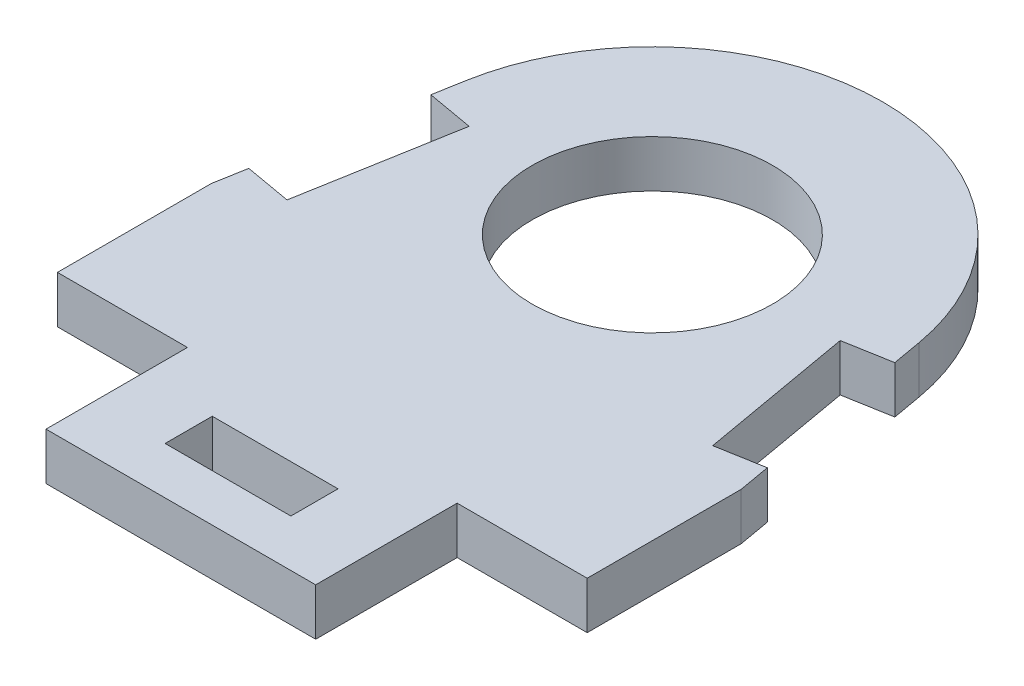
ISO-10303-21;
HEADER;
FILE_DESCRIPTION(('STEP AP214'),'2;1');
FILE_NAME('part.step','',(''),(''),'','','');
FILE_SCHEMA(('AUTOMOTIVE_DESIGN { 1 0 10303 214 1 1 1 1 }'));
ENDSEC;
DATA;
#1=APPLICATION_CONTEXT('core data for automotive mechanical design processes');
#2=APPLICATION_PROTOCOL_DEFINITION('international standard','automotive_design',2000,#1);
#3=PRODUCT_CONTEXT('',#1,'mechanical');
#4=PRODUCT('Part','Part','',(#3));
#5=PRODUCT_RELATED_PRODUCT_CATEGORY('part','',(#4));
#6=PRODUCT_DEFINITION_FORMATION('','',#4);
#7=PRODUCT_DEFINITION_CONTEXT('part definition',#1,'design');
#8=PRODUCT_DEFINITION('design','',#6,#7);
#9=PRODUCT_DEFINITION_SHAPE('','',#8);
#10=(LENGTH_UNIT() NAMED_UNIT(*) SI_UNIT(.MILLI.,.METRE.));
#11=(NAMED_UNIT(*) PLANE_ANGLE_UNIT() SI_UNIT($,.RADIAN.));
#12=(NAMED_UNIT(*) SI_UNIT($,.STERADIAN.) SOLID_ANGLE_UNIT());
#13=UNCERTAINTY_MEASURE_WITH_UNIT(LENGTH_MEASURE(1.E-05),#10,'distance_accuracy_value','');
#14=(GEOMETRIC_REPRESENTATION_CONTEXT(3) GLOBAL_UNCERTAINTY_ASSIGNED_CONTEXT((#13)) GLOBAL_UNIT_ASSIGNED_CONTEXT((#10,
#11,#12)) REPRESENTATION_CONTEXT('',''));
#15=CARTESIAN_POINT('',(0.,0.,0.));
#16=DIRECTION('',(0.,0.,1.));
#17=DIRECTION('',(1.,0.,0.));
#18=AXIS2_PLACEMENT_3D('',#15,#16,#17);
#19=CARTESIAN_POINT('',(4.,1.5,0.));
#20=DIRECTION('',(-1.,0.,0.));
#21=DIRECTION('',(0.,0.,1.));
#22=AXIS2_PLACEMENT_3D('',#19,#20,#21);
#23=PLANE('',#22);
#24=DIRECTION('',(0.,0.,-1.));
#25=VECTOR('',#24,1.);
#26=CARTESIAN_POINT('',(4.,-1.5,0.));
#27=LINE('',#26,#25);
#28=CARTESIAN_POINT('',(4.,-1.5,6.));
#29=VERTEX_POINT('',#28);
#30=CARTESIAN_POINT('',(4.,-1.5,3.));
#31=VERTEX_POINT('',#30);
#32=EDGE_CURVE('E271',#29,#31,#27,.T.);
#33=ORIENTED_EDGE('',*,*,#32,.F.);
#34=DIRECTION('',(0.,-1.,0.));
#35=VECTOR('',#34,1.);
#36=CARTESIAN_POINT('',(4.,1.5,6.));
#37=LINE('',#36,#35);
#38=CARTESIAN_POINT('',(4.,1.5,6.));
#39=VERTEX_POINT('',#38);
#40=EDGE_CURVE('E11',#39,#29,#37,.T.);
#41=ORIENTED_EDGE('',*,*,#40,.F.);
#42=DIRECTION('',(0.,0.,-1.));
#43=VECTOR('',#42,1.);
#44=CARTESIAN_POINT('',(4.,1.5,0.));
#45=LINE('',#44,#43);
#46=CARTESIAN_POINT('',(4.,1.5,3.));
#47=VERTEX_POINT('',#46);
#48=EDGE_CURVE('E219',#39,#47,#45,.T.);
#49=ORIENTED_EDGE('',*,*,#48,.T.);
#50=DIRECTION('',(0.,-1.,0.));
#51=VECTOR('',#50,1.);
#52=CARTESIAN_POINT('',(4.,1.5,3.));
#53=LINE('',#52,#51);
#54=EDGE_CURVE('E139',#47,#31,#53,.T.);
#55=ORIENTED_EDGE('',*,*,#54,.T.);
#56=EDGE_LOOP('',(#33,#41,#49,#55));
#57=FACE_BOUND('',#56,.T.);
#58=ADVANCED_FACE('F43',(#57),#23,.T.);
#59=CARTESIAN_POINT('',(0.,1.5,6.));
#60=DIRECTION('',(0.,0.,-1.));
#61=DIRECTION('',(-1.,0.,0.));
#62=AXIS2_PLACEMENT_3D('',#59,#60,#61);
#63=PLANE('',#62);
#64=DIRECTION('',(1.,0.,0.));
#65=VECTOR('',#64,1.);
#66=CARTESIAN_POINT('',(0.,-1.5,6.));
#67=LINE('',#66,#65);
#68=CARTESIAN_POINT('',(-4.,-1.5,6.));
#69=VERTEX_POINT('',#68);
#70=EDGE_CURVE('E209',#69,#29,#67,.T.);
#71=ORIENTED_EDGE('',*,*,#70,.F.);
#72=DIRECTION('',(0.,-1.,0.));
#73=VECTOR('',#72,1.);
#74=CARTESIAN_POINT('',(-4.,1.5,6.));
#75=LINE('',#74,#73);
#76=CARTESIAN_POINT('',(-4.,1.5,6.));
#77=VERTEX_POINT('',#76);
#78=EDGE_CURVE('E53',#77,#69,#75,.T.);
#79=ORIENTED_EDGE('',*,*,#78,.F.);
#80=DIRECTION('',(1.,0.,0.));
#81=VECTOR('',#80,1.);
#82=CARTESIAN_POINT('',(0.,1.5,6.));
#83=LINE('',#82,#81);
#84=EDGE_CURVE('E207',#77,#39,#83,.T.);
#85=ORIENTED_EDGE('',*,*,#84,.T.);
#86=ORIENTED_EDGE('',*,*,#40,.T.);
#87=EDGE_LOOP('',(#71,#79,#85,#86));
#88=FACE_BOUND('',#87,.T.);
#89=ADVANCED_FACE('F205',(#88),#63,.T.);
#90=CARTESIAN_POINT('',(-4.,1.5,0.));
#91=DIRECTION('',(-1.,0.,0.));
#92=DIRECTION('',(0.,0.,1.));
#93=AXIS2_PLACEMENT_3D('',#90,#91,#92);
#94=PLANE('',#93);
#95=DIRECTION('',(0.,0.,-1.));
#96=VECTOR('',#95,1.);
#97=CARTESIAN_POINT('',(-4.,-1.5,0.));
#98=LINE('',#97,#96);
#99=CARTESIAN_POINT('',(-4.,-1.5,3.));
#100=VERTEX_POINT('',#99);
#101=EDGE_CURVE('E274',#69,#100,#98,.T.);
#102=ORIENTED_EDGE('',*,*,#101,.T.);
#103=DIRECTION('',(0.,-1.,0.));
#104=VECTOR('',#103,1.);
#105=CARTESIAN_POINT('',(-4.,1.5,3.));
#106=LINE('',#105,#104);
#107=CARTESIAN_POINT('',(-4.,1.5,3.));
#108=VERTEX_POINT('',#107);
#109=EDGE_CURVE('E212',#108,#100,#106,.T.);
#110=ORIENTED_EDGE('',*,*,#109,.F.);
#111=DIRECTION('',(0.,0.,-1.));
#112=VECTOR('',#111,1.);
#113=CARTESIAN_POINT('',(-4.,1.5,0.));
#114=LINE('',#113,#112);
#115=EDGE_CURVE('E215',#77,#108,#114,.T.);
#116=ORIENTED_EDGE('',*,*,#115,.F.);
#117=ORIENTED_EDGE('',*,*,#78,.T.);
#118=EDGE_LOOP('',(#102,#110,#116,#117));
#119=FACE_BOUND('',#118,.T.);
#120=ADVANCED_FACE('F216',(#119),#94,.F.);
#121=CARTESIAN_POINT('',(0.,1.5,-21.));
#122=DIRECTION('',(0.,-1.,0.));
#123=DIRECTION('',(0.,0.,-1.));
#124=AXIS2_PLACEMENT_3D('',#121,#122,#123);
#125=CYLINDRICAL_SURFACE('',#124,14.65);
#126=CARTESIAN_POINT('',(0.,-1.5,-21.));
#127=DIRECTION('',(0.,1.,0.));
#128=DIRECTION('',(0.,0.,1.));
#129=AXIS2_PLACEMENT_3D('',#126,#127,#128);
#130=CIRCLE('',#129,14.65);
#131=CARTESIAN_POINT('',(-14.4274335816288,-1.5,-23.5439458028206));
#132=VERTEX_POINT('',#131);
#133=CARTESIAN_POINT('',(14.4274335816288,-1.5,-23.5439458028206));
#134=VERTEX_POINT('',#133);
#135=EDGE_CURVE('E227',#132,#134,#130,.F.);
#136=ORIENTED_EDGE('',*,*,#135,.F.);
#137=DIRECTION('',(0.,-1.,0.));
#138=VECTOR('',#137,1.);
#139=CARTESIAN_POINT('',(-14.4274335816288,1.5,-23.5439458028206));
#140=LINE('',#139,#138);
#141=CARTESIAN_POINT('',(-14.4274335816288,1.5,-23.5439458028206));
#142=VERTEX_POINT('',#141);
#143=EDGE_CURVE('E47',#142,#132,#140,.T.);
#144=ORIENTED_EDGE('',*,*,#143,.F.);
#145=CARTESIAN_POINT('',(0.,1.5,-21.));
#146=DIRECTION('',(0.,1.,0.));
#147=DIRECTION('',(0.,0.,1.));
#148=AXIS2_PLACEMENT_3D('',#145,#146,#147);
#149=CIRCLE('',#148,14.65);
#150=CARTESIAN_POINT('',(14.4274335816288,1.5,-23.5439458028206));
#151=VERTEX_POINT('',#150);
#152=EDGE_CURVE('E277',#142,#151,#149,.F.);
#153=ORIENTED_EDGE('',*,*,#152,.T.);
#154=DIRECTION('',(0.,-1.,0.));
#155=VECTOR('',#154,1.);
#156=CARTESIAN_POINT('',(14.4274335816288,1.5,-23.5439458028206));
#157=LINE('',#156,#155);
#158=EDGE_CURVE('E226',#151,#134,#157,.T.);
#159=ORIENTED_EDGE('',*,*,#158,.T.);
#160=EDGE_LOOP('',(#136,#144,#153,#159));
#161=FACE_BOUND('',#160,.T.);
#162=ADVANCED_FACE('F45',(#161),#125,.T.);
#163=CARTESIAN_POINT('',(-18.0186450865484,1.5,-3.17717328456859));
#164=DIRECTION('',(-0.984807753012207,0.,-0.173648177666935));
#165=DIRECTION('',(-0.173648177666935,0.,0.984807753012207));
#166=AXIS2_PLACEMENT_3D('',#163,#164,#165);
#167=PLANE('',#166);
#168=DIRECTION('',(0.173648177666935,0.,-0.984807753012207));
#169=VECTOR('',#168,1.);
#170=CARTESIAN_POINT('',(-18.0186450865484,-1.5,-3.17717328456859));
#171=LINE('',#170,#169);
#172=CARTESIAN_POINT('',(-14.7586065503315,-1.5,-21.6657705662686));
#173=VERTEX_POINT('',#172);
#174=EDGE_CURVE('E230',#173,#132,#171,.T.);
#175=ORIENTED_EDGE('',*,*,#174,.F.);
#176=DIRECTION('',(0.,-1.,0.));
#177=VECTOR('',#176,1.);
#178=CARTESIAN_POINT('',(-14.7586065503315,1.5,-21.6657705662686));
#179=LINE('',#178,#177);
#180=CARTESIAN_POINT('',(-14.7586065503315,1.5,-21.6657705662686));
#181=VERTEX_POINT('',#180);
#182=EDGE_CURVE('E318',#181,#173,#179,.T.);
#183=ORIENTED_EDGE('',*,*,#182,.F.);
#184=DIRECTION('',(0.173648177666935,0.,-0.984807753012207));
#185=VECTOR('',#184,1.);
#186=CARTESIAN_POINT('',(-18.0186450865484,1.5,-3.17717328456859));
#187=LINE('',#186,#185);
#188=EDGE_CURVE('E327',#181,#142,#187,.T.);
#189=ORIENTED_EDGE('',*,*,#188,.T.);
#190=ORIENTED_EDGE('',*,*,#143,.T.);
#191=EDGE_LOOP('',(#175,#183,#189,#190));
#192=FACE_BOUND('',#191,.T.);
#193=ADVANCED_FACE('F325',(#192),#167,.T.);
#194=CARTESIAN_POINT('',(3.26003853621698,1.5,-18.4885972817));
#195=DIRECTION('',(0.173648177666935,0.,-0.984807753012207));
#196=DIRECTION('',(-0.984807753012207,0.,-0.173648177666935));
#197=AXIS2_PLACEMENT_3D('',#194,#195,#196);
#198=PLANE('',#197);
#199=DIRECTION('',(0.984807753012207,0.,0.173648177666935));
#200=VECTOR('',#199,1.);
#201=CARTESIAN_POINT('',(3.26003853621698,-1.5,-18.4885972817));
#202=LINE('',#201,#200);
#203=CARTESIAN_POINT('',(-11.8041832912948,-1.5,-21.1448260332678));
#204=VERTEX_POINT('',#203);
#205=EDGE_CURVE('E233',#173,#204,#202,.T.);
#206=ORIENTED_EDGE('',*,*,#205,.T.);
#207=DIRECTION('',(0.,-1.,0.));
#208=VECTOR('',#207,1.);
#209=CARTESIAN_POINT('',(-11.8041832912948,1.5,-21.1448260332678));
#210=LINE('',#209,#208);
#211=CARTESIAN_POINT('',(-11.8041832912948,1.5,-21.1448260332678));
#212=VERTEX_POINT('',#211);
#213=EDGE_CURVE('E316',#212,#204,#210,.T.);
#214=ORIENTED_EDGE('',*,*,#213,.F.);
#215=DIRECTION('',(0.984807753012207,0.,0.173648177666935));
#216=VECTOR('',#215,1.);
#217=CARTESIAN_POINT('',(3.26003853621698,1.5,-18.4885972817));
#218=LINE('',#217,#216);
#219=EDGE_CURVE('E346',#181,#212,#218,.T.);
#220=ORIENTED_EDGE('',*,*,#219,.F.);
#221=ORIENTED_EDGE('',*,*,#182,.T.);
#222=EDGE_LOOP('',(#206,#214,#220,#221));
#223=FACE_BOUND('',#222,.T.);
#224=ADVANCED_FACE('F336',(#223),#198,.F.);
#225=CARTESIAN_POINT('',(-15.0642218275118,1.5,-2.65622875156778));
#226=DIRECTION('',(0.984807753012207,0.,0.173648177666935));
#227=DIRECTION('',(0.173648177666935,0.,-0.984807753012207));
#228=AXIS2_PLACEMENT_3D('',#225,#226,#227);
#229=PLANE('',#228);
#230=DIRECTION('',(-0.173648177666935,0.,0.984807753012207));
#231=VECTOR('',#230,1.);
#232=CARTESIAN_POINT('',(-15.0642218275118,-1.5,-2.65622875156778));
#233=LINE('',#232,#231);
#234=CARTESIAN_POINT('',(-13.5406650679642,-1.5,-11.2967485031457));
#235=VERTEX_POINT('',#234);
#236=EDGE_CURVE('E236',#204,#235,#233,.T.);
#237=ORIENTED_EDGE('',*,*,#236,.T.);
#238=DIRECTION('',(0.,-1.,0.));
#239=VECTOR('',#238,1.);
#240=CARTESIAN_POINT('',(-13.5406650679642,1.5,-11.2967485031457));
#241=LINE('',#240,#239);
#242=CARTESIAN_POINT('',(-13.5406650679642,1.5,-11.2967485031457));
#243=VERTEX_POINT('',#242);
#244=EDGE_CURVE('E314',#243,#235,#241,.T.);
#245=ORIENTED_EDGE('',*,*,#244,.F.);
#246=DIRECTION('',(-0.173648177666935,0.,0.984807753012207));
#247=VECTOR('',#246,1.);
#248=CARTESIAN_POINT('',(-15.0642218275118,1.5,-2.65622875156778));
#249=LINE('',#248,#247);
#250=EDGE_CURVE('E341',#212,#243,#249,.T.);
#251=ORIENTED_EDGE('',*,*,#250,.F.);
#252=ORIENTED_EDGE('',*,*,#213,.T.);
#253=EDGE_LOOP('',(#237,#245,#251,#252));
#254=FACE_BOUND('',#253,.T.);
#255=ADVANCED_FACE('F339',(#254),#229,.F.);
#256=CARTESIAN_POINT('',(1.52355675954763,1.5,-8.64051975157789));
#257=DIRECTION('',(0.173648177666935,0.,-0.984807753012207));
#258=DIRECTION('',(-0.984807753012207,0.,-0.173648177666935));
#259=AXIS2_PLACEMENT_3D('',#256,#257,#258);
#260=PLANE('',#259);
#261=DIRECTION('',(0.984807753012207,0.,0.173648177666935));
#262=VECTOR('',#261,1.);
#263=CARTESIAN_POINT('',(1.52355675954763,-1.5,-8.64051975157789));
#264=LINE('',#263,#262);
#265=CARTESIAN_POINT('',(-16.4950883270008,-1.5,-11.8176930361465));
#266=VERTEX_POINT('',#265);
#267=EDGE_CURVE('E239',#266,#235,#264,.T.);
#268=ORIENTED_EDGE('',*,*,#267,.F.);
#269=DIRECTION('',(0.,-1.,0.));
#270=VECTOR('',#269,1.);
#271=CARTESIAN_POINT('',(-16.4950883270008,1.5,-11.8176930361465));
#272=LINE('',#271,#270);
#273=CARTESIAN_POINT('',(-16.4950883270008,1.5,-11.8176930361465));
#274=VERTEX_POINT('',#273);
#275=EDGE_CURVE('E312',#274,#266,#272,.T.);
#276=ORIENTED_EDGE('',*,*,#275,.F.);
#277=DIRECTION('',(0.984807753012207,0.,0.173648177666935));
#278=VECTOR('',#277,1.);
#279=CARTESIAN_POINT('',(1.52355675954763,1.5,-8.64051975157789));
#280=LINE('',#279,#278);
#281=EDGE_CURVE('E345',#274,#243,#280,.T.);
#282=ORIENTED_EDGE('',*,*,#281,.T.);
#283=ORIENTED_EDGE('',*,*,#244,.T.);
#284=EDGE_LOOP('',(#268,#276,#282,#283));
#285=FACE_BOUND('',#284,.T.);
#286=ADVANCED_FACE('F445',(#285),#260,.T.);
#287=CARTESIAN_POINT('',(-16.852566459004,-1.5,-9.79033380520578));
#288=VERTEX_POINT('',#287);
#289=EDGE_CURVE('E234',#288,#266,#171,.T.);
#290=ORIENTED_EDGE('',*,*,#289,.F.);
#291=DIRECTION('',(0.,-1.,0.));
#292=VECTOR('',#291,1.);
#293=CARTESIAN_POINT('',(-16.852566459004,1.5,-9.79033380520578));
#294=LINE('',#293,#292);
#295=CARTESIAN_POINT('',(-16.852566459004,1.5,-9.79033380520578));
#296=VERTEX_POINT('',#295);
#297=EDGE_CURVE('E310',#296,#288,#294,.T.);
#298=ORIENTED_EDGE('',*,*,#297,.F.);
#299=EDGE_CURVE('E348',#296,#274,#187,.T.);
#300=ORIENTED_EDGE('',*,*,#299,.T.);
#301=ORIENTED_EDGE('',*,*,#275,.T.);
#302=EDGE_LOOP('',(#290,#298,#300,#301));
#303=FACE_BOUND('',#302,.T.);
#304=ADVANCED_FACE('F391',(#303),#167,.T.);
#305=CARTESIAN_POINT('',(-16.852566459004,1.5,0.));
#306=DIRECTION('',(-1.,0.,0.));
#307=DIRECTION('',(0.,0.,1.));
#308=AXIS2_PLACEMENT_3D('',#305,#306,#307);
#309=PLANE('',#308);
#310=DIRECTION('',(0.,0.,-1.));
#311=VECTOR('',#310,1.);
#312=CARTESIAN_POINT('',(-16.852566459004,-1.5,0.));
#313=LINE('',#312,#311);
#314=CARTESIAN_POINT('',(-16.852566459004,-1.5,0.));
#315=VERTEX_POINT('',#314);
#316=EDGE_CURVE('E242',#315,#288,#313,.T.);
#317=ORIENTED_EDGE('',*,*,#316,.F.);
#318=DIRECTION('',(0.,-1.,0.));
#319=VECTOR('',#318,1.);
#320=CARTESIAN_POINT('',(-16.852566459004,1.5,0.));
#321=LINE('',#320,#319);
#322=CARTESIAN_POINT('',(-16.852566459004,1.5,0.));
#323=VERTEX_POINT('',#322);
#324=EDGE_CURVE('E308',#323,#315,#321,.T.);
#325=ORIENTED_EDGE('',*,*,#324,.F.);
#326=DIRECTION('',(0.,0.,-1.));
#327=VECTOR('',#326,1.);
#328=CARTESIAN_POINT('',(-16.852566459004,1.5,0.));
#329=LINE('',#328,#327);
#330=EDGE_CURVE('E353',#323,#296,#329,.T.);
#331=ORIENTED_EDGE('',*,*,#330,.T.);
#332=ORIENTED_EDGE('',*,*,#297,.T.);
#333=EDGE_LOOP('',(#317,#325,#331,#332));
#334=FACE_BOUND('',#333,.T.);
#335=ADVANCED_FACE('F396',(#334),#309,.T.);
#336=CARTESIAN_POINT('',(0.,1.5,0.));
#337=DIRECTION('',(0.,0.,-1.));
#338=DIRECTION('',(-1.,0.,0.));
#339=AXIS2_PLACEMENT_3D('',#336,#337,#338);
#340=PLANE('',#339);
#341=DIRECTION('',(1.,0.,0.));
#342=VECTOR('',#341,1.);
#343=CARTESIAN_POINT('',(0.,-1.5,0.));
#344=LINE('',#343,#342);
#345=CARTESIAN_POINT('',(-8.57886645900403,-1.5,0.));
#346=VERTEX_POINT('',#345);
#347=EDGE_CURVE('E245',#315,#346,#344,.T.);
#348=ORIENTED_EDGE('',*,*,#347,.T.);
#349=DIRECTION('',(0.,-1.,0.));
#350=VECTOR('',#349,1.);
#351=CARTESIAN_POINT('',(-8.57886645900403,1.5,0.));
#352=LINE('',#351,#350);
#353=CARTESIAN_POINT('',(-8.57886645900403,1.5,0.));
#354=VERTEX_POINT('',#353);
#355=EDGE_CURVE('E305',#354,#346,#352,.T.);
#356=ORIENTED_EDGE('',*,*,#355,.F.);
#357=DIRECTION('',(1.,0.,0.));
#358=VECTOR('',#357,1.);
#359=CARTESIAN_POINT('',(0.,1.5,0.));
#360=LINE('',#359,#358);
#361=EDGE_CURVE('E356',#323,#354,#360,.T.);
#362=ORIENTED_EDGE('',*,*,#361,.F.);
#363=ORIENTED_EDGE('',*,*,#324,.T.);
#364=EDGE_LOOP('',(#348,#356,#362,#363));
#365=FACE_BOUND('',#364,.T.);
#366=ADVANCED_FACE('F401',(#365),#340,.F.);
#367=CARTESIAN_POINT('',(-8.57886645900403,1.5,0.));
#368=DIRECTION('',(1.,0.,0.));
#369=DIRECTION('',(0.,0.,-1.));
#370=AXIS2_PLACEMENT_3D('',#367,#368,#369);
#371=PLANE('',#370);
#372=DIRECTION('',(0.,0.,1.));
#373=VECTOR('',#372,1.);
#374=CARTESIAN_POINT('',(-8.57886645900403,-1.5,0.));
#375=LINE('',#374,#373);
#376=CARTESIAN_POINT('',(-8.57886645900403,-1.5,9.));
#377=VERTEX_POINT('',#376);
#378=EDGE_CURVE('E247',#346,#377,#375,.T.);
#379=ORIENTED_EDGE('',*,*,#378,.T.);
#380=DIRECTION('',(0.,-1.,0.));
#381=VECTOR('',#380,1.);
#382=CARTESIAN_POINT('',(-8.57886645900403,1.5,9.));
#383=LINE('',#382,#381);
#384=CARTESIAN_POINT('',(-8.57886645900403,1.5,9.));
#385=VERTEX_POINT('',#384);
#386=EDGE_CURVE('E302',#385,#377,#383,.T.);
#387=ORIENTED_EDGE('',*,*,#386,.F.);
#388=DIRECTION('',(0.,0.,1.));
#389=VECTOR('',#388,1.);
#390=CARTESIAN_POINT('',(-8.57886645900403,1.5,0.));
#391=LINE('',#390,#389);
#392=EDGE_CURVE('E358',#354,#385,#391,.T.);
#393=ORIENTED_EDGE('',*,*,#392,.F.);
#394=ORIENTED_EDGE('',*,*,#355,.T.);
#395=EDGE_LOOP('',(#379,#387,#393,#394));
#396=FACE_BOUND('',#395,.T.);
#397=ADVANCED_FACE('F407',(#396),#371,.F.);
#398=CARTESIAN_POINT('',(0.,1.5,9.));
#399=DIRECTION('',(0.,0.,-1.));
#400=DIRECTION('',(-1.,0.,0.));
#401=AXIS2_PLACEMENT_3D('',#398,#399,#400);
#402=PLANE('',#401);
#403=DIRECTION('',(1.,0.,0.));
#404=VECTOR('',#403,1.);
#405=CARTESIAN_POINT('',(0.,-1.5,9.));
#406=LINE('',#405,#404);
#407=CARTESIAN_POINT('',(8.57886645900403,-1.5,9.));
#408=VERTEX_POINT('',#407);
#409=EDGE_CURVE('E250',#377,#408,#406,.T.);
#410=ORIENTED_EDGE('',*,*,#409,.T.);
#411=DIRECTION('',(0.,-1.,0.));
#412=VECTOR('',#411,1.);
#413=CARTESIAN_POINT('',(8.57886645900403,1.5,9.));
#414=LINE('',#413,#412);
#415=CARTESIAN_POINT('',(8.57886645900403,1.5,9.));
#416=VERTEX_POINT('',#415);
#417=EDGE_CURVE('E299',#416,#408,#414,.T.);
#418=ORIENTED_EDGE('',*,*,#417,.F.);
#419=DIRECTION('',(1.,0.,0.));
#420=VECTOR('',#419,1.);
#421=CARTESIAN_POINT('',(0.,1.5,9.));
#422=LINE('',#421,#420);
#423=EDGE_CURVE('E361',#385,#416,#422,.T.);
#424=ORIENTED_EDGE('',*,*,#423,.F.);
#425=ORIENTED_EDGE('',*,*,#386,.T.);
#426=EDGE_LOOP('',(#410,#418,#424,#425));
#427=FACE_BOUND('',#426,.T.);
#428=ADVANCED_FACE('F411',(#427),#402,.F.);
#429=CARTESIAN_POINT('',(8.57886645900403,1.5,0.));
#430=DIRECTION('',(-1.,0.,0.));
#431=DIRECTION('',(0.,0.,1.));
#432=AXIS2_PLACEMENT_3D('',#429,#430,#431);
#433=PLANE('',#432);
#434=DIRECTION('',(0.,0.,-1.));
#435=VECTOR('',#434,1.);
#436=CARTESIAN_POINT('',(8.57886645900403,-1.5,0.));
#437=LINE('',#436,#435);
#438=CARTESIAN_POINT('',(8.57886645900403,-1.5,0.));
#439=VERTEX_POINT('',#438);
#440=EDGE_CURVE('E252',#408,#439,#437,.T.);
#441=ORIENTED_EDGE('',*,*,#440,.T.);
#442=DIRECTION('',(0.,-1.,0.));
#443=VECTOR('',#442,1.);
#444=CARTESIAN_POINT('',(8.57886645900403,1.5,0.));
#445=LINE('',#444,#443);
#446=CARTESIAN_POINT('',(8.57886645900403,1.5,0.));
#447=VERTEX_POINT('',#446);
#448=EDGE_CURVE('E296',#447,#439,#445,.T.);
#449=ORIENTED_EDGE('',*,*,#448,.F.);
#450=DIRECTION('',(0.,0.,-1.));
#451=VECTOR('',#450,1.);
#452=CARTESIAN_POINT('',(8.57886645900403,1.5,0.));
#453=LINE('',#452,#451);
#454=EDGE_CURVE('E363',#416,#447,#453,.T.);
#455=ORIENTED_EDGE('',*,*,#454,.F.);
#456=ORIENTED_EDGE('',*,*,#417,.T.);
#457=EDGE_LOOP('',(#441,#449,#455,#456));
#458=FACE_BOUND('',#457,.T.);
#459=ADVANCED_FACE('F416',(#458),#433,.F.);
#460=CARTESIAN_POINT('',(16.852566459004,-1.5,0.));
#461=VERTEX_POINT('',#460);
#462=EDGE_CURVE('E248',#439,#461,#344,.T.);
#463=ORIENTED_EDGE('',*,*,#462,.T.);
#464=DIRECTION('',(0.,-1.,0.));
#465=VECTOR('',#464,1.);
#466=CARTESIAN_POINT('',(16.852566459004,1.5,0.));
#467=LINE('',#466,#465);
#468=CARTESIAN_POINT('',(16.852566459004,1.5,0.));
#469=VERTEX_POINT('',#468);
#470=EDGE_CURVE('E293',#469,#461,#467,.T.);
#471=ORIENTED_EDGE('',*,*,#470,.F.);
#472=EDGE_CURVE('E359',#447,#469,#360,.T.);
#473=ORIENTED_EDGE('',*,*,#472,.F.);
#474=ORIENTED_EDGE('',*,*,#448,.T.);
#475=EDGE_LOOP('',(#463,#471,#473,#474));
#476=FACE_BOUND('',#475,.T.);
#477=ADVANCED_FACE('F422',(#476),#340,.F.);
#478=CARTESIAN_POINT('',(16.852566459004,1.5,0.));
#479=DIRECTION('',(-1.,0.,0.));
#480=DIRECTION('',(0.,0.,1.));
#481=AXIS2_PLACEMENT_3D('',#478,#479,#480);
#482=PLANE('',#481);
#483=DIRECTION('',(0.,0.,-1.));
#484=VECTOR('',#483,1.);
#485=CARTESIAN_POINT('',(16.852566459004,-1.5,0.));
#486=LINE('',#485,#484);
#487=CARTESIAN_POINT('',(16.852566459004,-1.5,-9.79033380520575));
#488=VERTEX_POINT('',#487);
#489=EDGE_CURVE('E254',#461,#488,#486,.T.);
#490=ORIENTED_EDGE('',*,*,#489,.T.);
#491=DIRECTION('',(0.,-1.,0.));
#492=VECTOR('',#491,1.);
#493=CARTESIAN_POINT('',(16.852566459004,1.5,-9.79033380520575));
#494=LINE('',#493,#492);
#495=CARTESIAN_POINT('',(16.852566459004,1.5,-9.79033380520575));
#496=VERTEX_POINT('',#495);
#497=EDGE_CURVE('E290',#496,#488,#494,.T.);
#498=ORIENTED_EDGE('',*,*,#497,.F.);
#499=DIRECTION('',(0.,0.,-1.));
#500=VECTOR('',#499,1.);
#501=CARTESIAN_POINT('',(16.852566459004,1.5,0.));
#502=LINE('',#501,#500);
#503=EDGE_CURVE('E365',#469,#496,#502,.T.);
#504=ORIENTED_EDGE('',*,*,#503,.F.);
#505=ORIENTED_EDGE('',*,*,#470,.T.);
#506=EDGE_LOOP('',(#490,#498,#504,#505));
#507=FACE_BOUND('',#506,.T.);
#508=ADVANCED_FACE('F426',(#507),#482,.F.);
#509=CARTESIAN_POINT('',(18.0186450865484,1.5,-3.17717328456859));
#510=DIRECTION('',(-0.984807753012207,0.,0.173648177666935));
#511=DIRECTION('',(0.173648177666935,0.,0.984807753012207));
#512=AXIS2_PLACEMENT_3D('',#509,#510,#511);
#513=PLANE('',#512);
#514=DIRECTION('',(-0.173648177666935,0.,-0.984807753012207));
#515=VECTOR('',#514,1.);
#516=CARTESIAN_POINT('',(18.0186450865484,-1.5,-3.17717328456859));
#517=LINE('',#516,#515);
#518=CARTESIAN_POINT('',(16.4950883270008,-1.5,-11.8176930361465));
#519=VERTEX_POINT('',#518);
#520=EDGE_CURVE('E256',#488,#519,#517,.T.);
#521=ORIENTED_EDGE('',*,*,#520,.T.);
#522=DIRECTION('',(0.,-1.,0.));
#523=VECTOR('',#522,1.);
#524=CARTESIAN_POINT('',(16.4950883270008,1.5,-11.8176930361465));
#525=LINE('',#524,#523);
#526=CARTESIAN_POINT('',(16.4950883270008,1.5,-11.8176930361465));
#527=VERTEX_POINT('',#526);
#528=EDGE_CURVE('E287',#527,#519,#525,.T.);
#529=ORIENTED_EDGE('',*,*,#528,.F.);
#530=DIRECTION('',(-0.173648177666935,0.,-0.984807753012207));
#531=VECTOR('',#530,1.);
#532=CARTESIAN_POINT('',(18.0186450865484,1.5,-3.17717328456859));
#533=LINE('',#532,#531);
#534=EDGE_CURVE('E367',#496,#527,#533,.T.);
#535=ORIENTED_EDGE('',*,*,#534,.F.);
#536=ORIENTED_EDGE('',*,*,#497,.T.);
#537=EDGE_LOOP('',(#521,#529,#535,#536));
#538=FACE_BOUND('',#537,.T.);
#539=ADVANCED_FACE('F431',(#538),#513,.F.);
#540=CARTESIAN_POINT('',(-1.52355675954762,1.5,-8.6405197515779));
#541=DIRECTION('',(0.173648177666934,0.,0.984807753012207));
#542=DIRECTION('',(0.984807753012207,0.,-0.173648177666935));
#543=AXIS2_PLACEMENT_3D('',#540,#541,#542);
#544=PLANE('',#543);
#545=DIRECTION('',(-0.984807753012207,0.,0.173648177666935));
#546=VECTOR('',#545,1.);
#547=CARTESIAN_POINT('',(-1.52355675954762,-1.5,-8.6405197515779));
#548=LINE('',#547,#546);
#549=CARTESIAN_POINT('',(13.5406650679642,-1.5,-11.2967485031457));
#550=VERTEX_POINT('',#549);
#551=EDGE_CURVE('E258',#519,#550,#548,.T.);
#552=ORIENTED_EDGE('',*,*,#551,.T.);
#553=DIRECTION('',(0.,-1.,0.));
#554=VECTOR('',#553,1.);
#555=CARTESIAN_POINT('',(13.5406650679642,1.5,-11.2967485031457));
#556=LINE('',#555,#554);
#557=CARTESIAN_POINT('',(13.5406650679642,1.5,-11.2967485031457));
#558=VERTEX_POINT('',#557);
#559=EDGE_CURVE('E285',#558,#550,#556,.T.);
#560=ORIENTED_EDGE('',*,*,#559,.F.);
#561=DIRECTION('',(-0.984807753012207,0.,0.173648177666935));
#562=VECTOR('',#561,1.);
#563=CARTESIAN_POINT('',(-1.52355675954762,1.5,-8.6405197515779));
#564=LINE('',#563,#562);
#565=EDGE_CURVE('E369',#527,#558,#564,.T.);
#566=ORIENTED_EDGE('',*,*,#565,.F.);
#567=ORIENTED_EDGE('',*,*,#528,.T.);
#568=EDGE_LOOP('',(#552,#560,#566,#567));
#569=FACE_BOUND('',#568,.T.);
#570=ADVANCED_FACE('F435',(#569),#544,.F.);
#571=CARTESIAN_POINT('',(15.0642218275118,1.5,-2.65622875156778));
#572=DIRECTION('',(0.984807753012207,0.,-0.173648177666935));
#573=DIRECTION('',(-0.173648177666935,0.,-0.984807753012207));
#574=AXIS2_PLACEMENT_3D('',#571,#572,#573);
#575=PLANE('',#574);
#576=DIRECTION('',(0.173648177666935,0.,0.984807753012207));
#577=VECTOR('',#576,1.);
#578=CARTESIAN_POINT('',(15.0642218275118,-1.5,-2.65622875156778));
#579=LINE('',#578,#577);
#580=CARTESIAN_POINT('',(11.8041832912948,-1.5,-21.1448260332678));
#581=VERTEX_POINT('',#580);
#582=EDGE_CURVE('E262',#581,#550,#579,.T.);
#583=ORIENTED_EDGE('',*,*,#582,.F.);
#584=DIRECTION('',(0.,-1.,0.));
#585=VECTOR('',#584,1.);
#586=CARTESIAN_POINT('',(11.8041832912948,1.5,-21.1448260332678));
#587=LINE('',#586,#585);
#588=CARTESIAN_POINT('',(11.8041832912948,1.5,-21.1448260332678));
#589=VERTEX_POINT('',#588);
#590=EDGE_CURVE('E283',#589,#581,#587,.T.);
#591=ORIENTED_EDGE('',*,*,#590,.F.);
#592=DIRECTION('',(0.173648177666935,0.,0.984807753012207));
#593=VECTOR('',#592,1.);
#594=CARTESIAN_POINT('',(15.0642218275118,1.5,-2.65622875156778));
#595=LINE('',#594,#593);
#596=EDGE_CURVE('E372',#589,#558,#595,.T.);
#597=ORIENTED_EDGE('',*,*,#596,.T.);
#598=ORIENTED_EDGE('',*,*,#559,.T.);
#599=EDGE_LOOP('',(#583,#591,#597,#598));
#600=FACE_BOUND('',#599,.T.);
#601=ADVANCED_FACE('F439',(#600),#575,.T.);
#602=CARTESIAN_POINT('',(-3.26003853621696,1.5,-18.4885972817));
#603=DIRECTION('',(0.173648177666934,0.,0.984807753012207));
#604=DIRECTION('',(0.984807753012208,0.,-0.173648177666934));
#605=AXIS2_PLACEMENT_3D('',#602,#603,#604);
#606=PLANE('',#605);
#607=DIRECTION('',(-0.984807753012208,0.,0.173648177666934));
#608=VECTOR('',#607,1.);
#609=CARTESIAN_POINT('',(-3.26003853621696,-1.5,-18.4885972817));
#610=LINE('',#609,#608);
#611=CARTESIAN_POINT('',(14.7586065503315,-1.5,-21.6657705662686));
#612=VERTEX_POINT('',#611);
#613=EDGE_CURVE('E265',#612,#581,#610,.T.);
#614=ORIENTED_EDGE('',*,*,#613,.F.);
#615=DIRECTION('',(0.,-1.,0.));
#616=VECTOR('',#615,1.);
#617=CARTESIAN_POINT('',(14.7586065503315,1.5,-21.6657705662686));
#618=LINE('',#617,#616);
#619=CARTESIAN_POINT('',(14.7586065503315,1.5,-21.6657705662686));
#620=VERTEX_POINT('',#619);
#621=EDGE_CURVE('E281',#620,#612,#618,.T.);
#622=ORIENTED_EDGE('',*,*,#621,.F.);
#623=DIRECTION('',(-0.984807753012208,0.,0.173648177666934));
#624=VECTOR('',#623,1.);
#625=CARTESIAN_POINT('',(-3.26003853621696,1.5,-18.4885972817));
#626=LINE('',#625,#624);
#627=EDGE_CURVE('E375',#620,#589,#626,.T.);
#628=ORIENTED_EDGE('',*,*,#627,.T.);
#629=ORIENTED_EDGE('',*,*,#590,.T.);
#630=EDGE_LOOP('',(#614,#622,#628,#629));
#631=FACE_BOUND('',#630,.T.);
#632=ADVANCED_FACE('F442',(#631),#606,.T.);
#633=CARTESIAN_POINT('',(0.,1.5,-21.));
#634=DIRECTION('',(0.,-1.,0.));
#635=DIRECTION('',(0.,0.,-1.));
#636=AXIS2_PLACEMENT_3D('',#633,#634,#635);
#637=CYLINDRICAL_SURFACE('',#636,7.65);
#638=CARTESIAN_POINT('',(0.,1.5,-21.));
#639=DIRECTION('',(0.,1.,0.));
#640=DIRECTION('',(0.,0.,1.));
#641=AXIS2_PLACEMENT_3D('',#638,#639,#640);
#642=CIRCLE('',#641,7.65);
#643=CARTESIAN_POINT('',(0.,1.5,-13.35));
#644=VERTEX_POINT('',#643);
#645=EDGE_CURVE('E221',#644,#644,#642,.T.);
#646=ORIENTED_EDGE('',*,*,#645,.T.);
#647=EDGE_LOOP('',(#646));
#648=FACE_BOUND('',#647,.T.);
#649=CARTESIAN_POINT('',(0.,-1.5,-21.));
#650=DIRECTION('',(0.,1.,0.));
#651=DIRECTION('',(0.,0.,1.));
#652=AXIS2_PLACEMENT_3D('',#649,#650,#651);
#653=CIRCLE('',#652,7.65);
#654=CARTESIAN_POINT('',(0.,-1.5,-13.35));
#655=VERTEX_POINT('',#654);
#656=EDGE_CURVE('E268',#655,#655,#653,.T.);
#657=ORIENTED_EDGE('',*,*,#656,.F.);
#658=EDGE_LOOP('',(#657));
#659=FACE_BOUND('',#658,.T.);
#660=ADVANCED_FACE('F462',(#648,#659),#637,.F.);
#661=EDGE_CURVE('E259',#612,#134,#517,.T.);
#662=ORIENTED_EDGE('',*,*,#661,.T.);
#663=ORIENTED_EDGE('',*,*,#158,.F.);
#664=EDGE_CURVE('E370',#620,#151,#533,.T.);
#665=ORIENTED_EDGE('',*,*,#664,.F.);
#666=ORIENTED_EDGE('',*,*,#621,.T.);
#667=EDGE_LOOP('',(#662,#663,#665,#666));
#668=FACE_BOUND('',#667,.T.);
#669=ADVANCED_FACE('F385',(#668),#513,.F.);
#670=CARTESIAN_POINT('',(0.,1.5,3.));
#671=DIRECTION('',(0.,0.,-1.));
#672=DIRECTION('',(-1.,0.,0.));
#673=AXIS2_PLACEMENT_3D('',#670,#671,#672);
#674=PLANE('',#673);
#675=DIRECTION('',(1.,0.,0.));
#676=VECTOR('',#675,1.);
#677=CARTESIAN_POINT('',(0.,-1.5,3.));
#678=LINE('',#677,#676);
#679=EDGE_CURVE('E132',#100,#31,#678,.T.);
#680=ORIENTED_EDGE('',*,*,#679,.T.);
#681=ORIENTED_EDGE('',*,*,#54,.F.);
#682=DIRECTION('',(1.,0.,0.));
#683=VECTOR('',#682,1.);
#684=CARTESIAN_POINT('',(0.,1.5,3.));
#685=LINE('',#684,#683);
#686=EDGE_CURVE('E62',#108,#47,#685,.T.);
#687=ORIENTED_EDGE('',*,*,#686,.F.);
#688=ORIENTED_EDGE('',*,*,#109,.T.);
#689=EDGE_LOOP('',(#680,#681,#687,#688));
#690=FACE_BOUND('',#689,.T.);
#691=ADVANCED_FACE('F467',(#690),#674,.F.);
#692=CARTESIAN_POINT('',(0.,1.5,0.));
#693=DIRECTION('',(0.,1.,0.));
#694=DIRECTION('',(0.,0.,1.));
#695=AXIS2_PLACEMENT_3D('',#692,#693,#694);
#696=PLANE('',#695);
#697=ORIENTED_EDGE('',*,*,#152,.F.);
#698=ORIENTED_EDGE('',*,*,#188,.F.);
#699=ORIENTED_EDGE('',*,*,#219,.T.);
#700=ORIENTED_EDGE('',*,*,#250,.T.);
#701=ORIENTED_EDGE('',*,*,#281,.F.);
#702=ORIENTED_EDGE('',*,*,#299,.F.);
#703=ORIENTED_EDGE('',*,*,#330,.F.);
#704=ORIENTED_EDGE('',*,*,#361,.T.);
#705=ORIENTED_EDGE('',*,*,#392,.T.);
#706=ORIENTED_EDGE('',*,*,#423,.T.);
#707=ORIENTED_EDGE('',*,*,#454,.T.);
#708=ORIENTED_EDGE('',*,*,#472,.T.);
#709=ORIENTED_EDGE('',*,*,#503,.T.);
#710=ORIENTED_EDGE('',*,*,#534,.T.);
#711=ORIENTED_EDGE('',*,*,#565,.T.);
#712=ORIENTED_EDGE('',*,*,#596,.F.);
#713=ORIENTED_EDGE('',*,*,#627,.F.);
#714=ORIENTED_EDGE('',*,*,#664,.T.);
#715=EDGE_LOOP('',(#697,#698,#699,#700,#701,#702,#703,#704,#705,#706,#707,#708,#709,#710,#711,
#712,#713,#714));
#716=FACE_BOUND('',#715,.T.);
#717=ORIENTED_EDGE('',*,*,#645,.F.);
#718=EDGE_LOOP('',(#717));
#719=FACE_BOUND('',#718,.T.);
#720=ORIENTED_EDGE('',*,*,#48,.F.);
#721=ORIENTED_EDGE('',*,*,#84,.F.);
#722=ORIENTED_EDGE('',*,*,#115,.T.);
#723=ORIENTED_EDGE('',*,*,#686,.T.);
#724=EDGE_LOOP('',(#720,#721,#722,#723));
#725=FACE_BOUND('',#724,.T.);
#726=ADVANCED_FACE('F218',(#716,#719,#725),#696,.T.);
#727=CARTESIAN_POINT('',(0.,-1.5,0.));
#728=DIRECTION('',(0.,1.,0.));
#729=DIRECTION('',(0.,0.,1.));
#730=AXIS2_PLACEMENT_3D('',#727,#728,#729);
#731=PLANE('',#730);
#732=ORIENTED_EDGE('',*,*,#135,.T.);
#733=ORIENTED_EDGE('',*,*,#661,.F.);
#734=ORIENTED_EDGE('',*,*,#613,.T.);
#735=ORIENTED_EDGE('',*,*,#582,.T.);
#736=ORIENTED_EDGE('',*,*,#551,.F.);
#737=ORIENTED_EDGE('',*,*,#520,.F.);
#738=ORIENTED_EDGE('',*,*,#489,.F.);
#739=ORIENTED_EDGE('',*,*,#462,.F.);
#740=ORIENTED_EDGE('',*,*,#440,.F.);
#741=ORIENTED_EDGE('',*,*,#409,.F.);
#742=ORIENTED_EDGE('',*,*,#378,.F.);
#743=ORIENTED_EDGE('',*,*,#347,.F.);
#744=ORIENTED_EDGE('',*,*,#316,.T.);
#745=ORIENTED_EDGE('',*,*,#289,.T.);
#746=ORIENTED_EDGE('',*,*,#267,.T.);
#747=ORIENTED_EDGE('',*,*,#236,.F.);
#748=ORIENTED_EDGE('',*,*,#205,.F.);
#749=ORIENTED_EDGE('',*,*,#174,.T.);
#750=EDGE_LOOP('',(#732,#733,#734,#735,#736,#737,#738,#739,#740,#741,#742,#743,#744,#745,#746,
#747,#748,#749));
#751=FACE_BOUND('',#750,.T.);
#752=ORIENTED_EDGE('',*,*,#656,.T.);
#753=EDGE_LOOP('',(#752));
#754=FACE_BOUND('',#753,.T.);
#755=ORIENTED_EDGE('',*,*,#32,.T.);
#756=ORIENTED_EDGE('',*,*,#679,.F.);
#757=ORIENTED_EDGE('',*,*,#101,.F.);
#758=ORIENTED_EDGE('',*,*,#70,.T.);
#759=EDGE_LOOP('',(#755,#756,#757,#758));
#760=FACE_BOUND('',#759,.T.);
#761=ADVANCED_FACE('F332',(#751,#754,#760),#731,.F.);
#762=CLOSED_SHELL('',(#58,#89,#120,#162,#193,#224,#255,#286,#304,#335,#366,#397,#428,#459,#477,
#508,#539,#570,#601,#632,#660,#669,#691,#726,#761));
#763=MANIFOLD_SOLID_BREP('B2',#762);
#764=ADVANCED_BREP_SHAPE_REPRESENTATION('',(#18,#763),#14);
#765=SHAPE_DEFINITION_REPRESENTATION(#9,#764);
ENDSEC;
END-ISO-10303-21;
